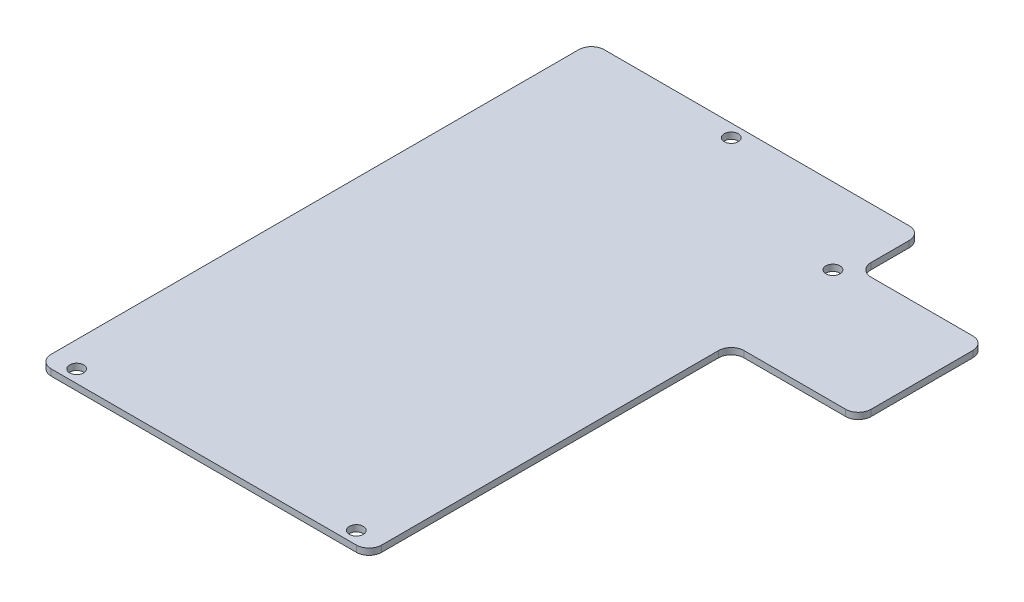
ISO-10303-21;
HEADER;
FILE_DESCRIPTION(('STEP AP214'),'2;1');
FILE_NAME('part.step','',(''),(''),'','','');
FILE_SCHEMA(('AUTOMOTIVE_DESIGN { 1 0 10303 214 1 1 1 1 }'));
ENDSEC;
DATA;
#1=APPLICATION_CONTEXT('core data for automotive mechanical design processes');
#2=APPLICATION_PROTOCOL_DEFINITION('international standard','automotive_design',2000,#1);
#3=PRODUCT_CONTEXT('',#1,'mechanical');
#4=PRODUCT('Part','Part','',(#3));
#5=PRODUCT_RELATED_PRODUCT_CATEGORY('part','',(#4));
#6=PRODUCT_DEFINITION_FORMATION('','',#4);
#7=PRODUCT_DEFINITION_CONTEXT('part definition',#1,'design');
#8=PRODUCT_DEFINITION('design','',#6,#7);
#9=PRODUCT_DEFINITION_SHAPE('','',#8);
#10=(LENGTH_UNIT() NAMED_UNIT(*) SI_UNIT(.MILLI.,.METRE.));
#11=(NAMED_UNIT(*) PLANE_ANGLE_UNIT() SI_UNIT($,.RADIAN.));
#12=(NAMED_UNIT(*) SI_UNIT($,.STERADIAN.) SOLID_ANGLE_UNIT());
#13=UNCERTAINTY_MEASURE_WITH_UNIT(LENGTH_MEASURE(1.E-05),#10,'distance_accuracy_value','');
#14=(GEOMETRIC_REPRESENTATION_CONTEXT(3) GLOBAL_UNCERTAINTY_ASSIGNED_CONTEXT((#13)) GLOBAL_UNIT_ASSIGNED_CONTEXT((#10,
#11,#12)) REPRESENTATION_CONTEXT('',''));
#15=CARTESIAN_POINT('',(0.,0.,0.));
#16=DIRECTION('',(0.,0.,1.));
#17=DIRECTION('',(1.,0.,0.));
#18=AXIS2_PLACEMENT_3D('',#15,#16,#17);
#19=CARTESIAN_POINT('',(0.,1.,0.));
#20=DIRECTION('',(1.,0.,0.));
#21=DIRECTION('',(0.,0.,-1.));
#22=AXIS2_PLACEMENT_3D('',#19,#20,#21);
#23=PLANE('',#22);
#24=DIRECTION('',(0.,0.,1.));
#25=VECTOR('',#24,1.);
#26=CARTESIAN_POINT('',(0.,1.,0.));
#27=LINE('',#26,#25);
#28=CARTESIAN_POINT('',(0.,1.,-85.));
#29=VERTEX_POINT('',#28);
#30=CARTESIAN_POINT('',(0.,1.,-2.));
#31=VERTEX_POINT('',#30);
#32=EDGE_CURVE('E174',#29,#31,#27,.T.);
#33=ORIENTED_EDGE('',*,*,#32,.F.);
#34=DIRECTION('',(0.,-1.,0.));
#35=VECTOR('',#34,1.);
#36=CARTESIAN_POINT('',(0.,1.,-85.));
#37=LINE('',#36,#35);
#38=CARTESIAN_POINT('',(0.,0.,-85.));
#39=VERTEX_POINT('',#38);
#40=EDGE_CURVE('E158',#29,#39,#37,.T.);
#41=ORIENTED_EDGE('',*,*,#40,.T.);
#42=DIRECTION('',(0.,0.,1.));
#43=VECTOR('',#42,1.);
#44=CARTESIAN_POINT('',(0.,0.,0.));
#45=LINE('',#44,#43);
#46=CARTESIAN_POINT('',(0.,0.,-2.));
#47=VERTEX_POINT('',#46);
#48=EDGE_CURVE('E171',#39,#47,#45,.T.);
#49=ORIENTED_EDGE('',*,*,#48,.T.);
#50=DIRECTION('',(0.,-1.,0.));
#51=VECTOR('',#50,1.);
#52=CARTESIAN_POINT('',(0.,1.,-2.));
#53=LINE('',#52,#51);
#54=EDGE_CURVE('E177',#47,#31,#53,.F.);
#55=ORIENTED_EDGE('',*,*,#54,.T.);
#56=EDGE_LOOP('',(#33,#41,#49,#55));
#57=FACE_BOUND('',#56,.T.);
#58=ADVANCED_FACE('F39',(#57),#23,.F.);
#59=CARTESIAN_POINT('',(0.,1.,0.));
#60=DIRECTION('',(0.,0.,-1.));
#61=DIRECTION('',(-1.,0.,0.));
#62=AXIS2_PLACEMENT_3D('',#59,#60,#61);
#63=PLANE('',#62);
#64=DIRECTION('',(1.,0.,0.));
#65=VECTOR('',#64,1.);
#66=CARTESIAN_POINT('',(0.,0.,0.));
#67=LINE('',#66,#65);
#68=CARTESIAN_POINT('',(2.,0.,0.));
#69=VERTEX_POINT('',#68);
#70=CARTESIAN_POINT('',(50.,0.,0.));
#71=VERTEX_POINT('',#70);
#72=EDGE_CURVE('E182',#69,#71,#67,.T.);
#73=ORIENTED_EDGE('',*,*,#72,.T.);
#74=DIRECTION('',(0.,-1.,0.));
#75=VECTOR('',#74,1.);
#76=CARTESIAN_POINT('',(50.,1.,0.));
#77=LINE('',#76,#75);
#78=CARTESIAN_POINT('',(50.,1.,0.));
#79=VERTEX_POINT('',#78);
#80=EDGE_CURVE('E306',#71,#79,#77,.F.);
#81=ORIENTED_EDGE('',*,*,#80,.T.);
#82=DIRECTION('',(1.,0.,0.));
#83=VECTOR('',#82,1.);
#84=CARTESIAN_POINT('',(0.,1.,0.));
#85=LINE('',#84,#83);
#86=CARTESIAN_POINT('',(2.,1.,0.));
#87=VERTEX_POINT('',#86);
#88=EDGE_CURVE('E344',#87,#79,#85,.T.);
#89=ORIENTED_EDGE('',*,*,#88,.F.);
#90=DIRECTION('',(0.,-1.,0.));
#91=VECTOR('',#90,1.);
#92=CARTESIAN_POINT('',(2.,1.,0.));
#93=LINE('',#92,#91);
#94=EDGE_CURVE('E302',#87,#69,#93,.T.);
#95=ORIENTED_EDGE('',*,*,#94,.T.);
#96=EDGE_LOOP('',(#73,#81,#89,#95));
#97=FACE_BOUND('',#96,.T.);
#98=ADVANCED_FACE('F391',(#97),#63,.F.);
#99=CARTESIAN_POINT('',(52.,1.,0.));
#100=DIRECTION('',(-1.,0.,0.));
#101=DIRECTION('',(0.,0.,1.));
#102=AXIS2_PLACEMENT_3D('',#99,#100,#101);
#103=PLANE('',#102);
#104=DIRECTION('',(0.,0.,-1.));
#105=VECTOR('',#104,1.);
#106=CARTESIAN_POINT('',(52.,0.,0.));
#107=LINE('',#106,#105);
#108=CARTESIAN_POINT('',(52.,0.,-2.));
#109=VERTEX_POINT('',#108);
#110=CARTESIAN_POINT('',(52.,0.,-55.));
#111=VERTEX_POINT('',#110);
#112=EDGE_CURVE('E188',#109,#111,#107,.T.);
#113=ORIENTED_EDGE('',*,*,#112,.T.);
#114=DIRECTION('',(0.,-1.,0.));
#115=VECTOR('',#114,1.);
#116=CARTESIAN_POINT('',(52.,1.,-55.));
#117=LINE('',#116,#115);
#118=CARTESIAN_POINT('',(52.,1.,-55.));
#119=VERTEX_POINT('',#118);
#120=EDGE_CURVE('E299',#111,#119,#117,.F.);
#121=ORIENTED_EDGE('',*,*,#120,.T.);
#122=DIRECTION('',(0.,0.,-1.));
#123=VECTOR('',#122,1.);
#124=CARTESIAN_POINT('',(52.,1.,0.));
#125=LINE('',#124,#123);
#126=CARTESIAN_POINT('',(52.,1.,-2.));
#127=VERTEX_POINT('',#126);
#128=EDGE_CURVE('E332',#127,#119,#125,.T.);
#129=ORIENTED_EDGE('',*,*,#128,.F.);
#130=DIRECTION('',(0.,-1.,0.));
#131=VECTOR('',#130,1.);
#132=CARTESIAN_POINT('',(52.,1.,-2.));
#133=LINE('',#132,#131);
#134=EDGE_CURVE('E295',#127,#109,#133,.T.);
#135=ORIENTED_EDGE('',*,*,#134,.T.);
#136=EDGE_LOOP('',(#113,#121,#129,#135));
#137=FACE_BOUND('',#136,.T.);
#138=ADVANCED_FACE('F320',(#137),#103,.F.);
#139=CARTESIAN_POINT('',(52.,1.,-57.));
#140=DIRECTION('',(0.,0.,-1.));
#141=DIRECTION('',(-1.,0.,0.));
#142=AXIS2_PLACEMENT_3D('',#139,#140,#141);
#143=PLANE('',#142);
#144=DIRECTION('',(1.,0.,0.));
#145=VECTOR('',#144,1.);
#146=CARTESIAN_POINT('',(52.,0.,-57.));
#147=LINE('',#146,#145);
#148=CARTESIAN_POINT('',(54.,0.,-57.));
#149=VERTEX_POINT('',#148);
#150=CARTESIAN_POINT('',(70.,0.,-57.));
#151=VERTEX_POINT('',#150);
#152=EDGE_CURVE('E200',#149,#151,#147,.T.);
#153=ORIENTED_EDGE('',*,*,#152,.T.);
#154=DIRECTION('',(0.,-1.,0.));
#155=VECTOR('',#154,1.);
#156=CARTESIAN_POINT('',(70.,1.,-57.));
#157=LINE('',#156,#155);
#158=CARTESIAN_POINT('',(70.,1.,-57.));
#159=VERTEX_POINT('',#158);
#160=EDGE_CURVE('E292',#151,#159,#157,.F.);
#161=ORIENTED_EDGE('',*,*,#160,.T.);
#162=DIRECTION('',(1.,0.,0.));
#163=VECTOR('',#162,1.);
#164=CARTESIAN_POINT('',(52.,1.,-57.));
#165=LINE('',#164,#163);
#166=CARTESIAN_POINT('',(54.,1.,-57.));
#167=VERTEX_POINT('',#166);
#168=EDGE_CURVE('E330',#167,#159,#165,.T.);
#169=ORIENTED_EDGE('',*,*,#168,.F.);
#170=DIRECTION('',(0.,-1.,0.));
#171=VECTOR('',#170,1.);
#172=CARTESIAN_POINT('',(54.,0.,-57.));
#173=LINE('',#172,#171);
#174=EDGE_CURVE('E288',#167,#149,#173,.T.);
#175=ORIENTED_EDGE('',*,*,#174,.T.);
#176=EDGE_LOOP('',(#153,#161,#169,#175));
#177=FACE_BOUND('',#176,.T.);
#178=ADVANCED_FACE('F334',(#177),#143,.F.);
#179=CARTESIAN_POINT('',(72.,1.,-77.));
#180=DIRECTION('',(-1.,0.,0.));
#181=DIRECTION('',(0.,0.,1.));
#182=AXIS2_PLACEMENT_3D('',#179,#180,#181);
#183=PLANE('',#182);
#184=DIRECTION('',(0.,0.,-1.));
#185=VECTOR('',#184,1.);
#186=CARTESIAN_POINT('',(72.,0.,-77.));
#187=LINE('',#186,#185);
#188=CARTESIAN_POINT('',(72.,0.,-59.));
#189=VERTEX_POINT('',#188);
#190=CARTESIAN_POINT('',(72.,0.,-75.));
#191=VERTEX_POINT('',#190);
#192=EDGE_CURVE('E204',#189,#191,#187,.T.);
#193=ORIENTED_EDGE('',*,*,#192,.T.);
#194=DIRECTION('',(0.,-1.,0.));
#195=VECTOR('',#194,1.);
#196=CARTESIAN_POINT('',(72.,1.,-75.));
#197=LINE('',#196,#195);
#198=CARTESIAN_POINT('',(72.,1.,-75.));
#199=VERTEX_POINT('',#198);
#200=EDGE_CURVE('E285',#191,#199,#197,.F.);
#201=ORIENTED_EDGE('',*,*,#200,.T.);
#202=DIRECTION('',(0.,0.,-1.));
#203=VECTOR('',#202,1.);
#204=CARTESIAN_POINT('',(72.,1.,-77.));
#205=LINE('',#204,#203);
#206=CARTESIAN_POINT('',(72.,1.,-59.));
#207=VERTEX_POINT('',#206);
#208=EDGE_CURVE('E337',#207,#199,#205,.T.);
#209=ORIENTED_EDGE('',*,*,#208,.F.);
#210=DIRECTION('',(0.,-1.,0.));
#211=VECTOR('',#210,1.);
#212=CARTESIAN_POINT('',(72.,1.,-59.));
#213=LINE('',#212,#211);
#214=EDGE_CURVE('E281',#207,#189,#213,.T.);
#215=ORIENTED_EDGE('',*,*,#214,.T.);
#216=EDGE_LOOP('',(#193,#201,#209,#215));
#217=FACE_BOUND('',#216,.T.);
#218=ADVANCED_FACE('F376',(#217),#183,.F.);
#219=CARTESIAN_POINT('',(52.,1.,-77.));
#220=DIRECTION('',(0.,0.,1.));
#221=DIRECTION('',(1.,0.,0.));
#222=AXIS2_PLACEMENT_3D('',#219,#220,#221);
#223=PLANE('',#222);
#224=DIRECTION('',(-1.,0.,0.));
#225=VECTOR('',#224,1.);
#226=CARTESIAN_POINT('',(52.,0.,-77.));
#227=LINE('',#226,#225);
#228=CARTESIAN_POINT('',(70.,0.,-77.));
#229=VERTEX_POINT('',#228);
#230=CARTESIAN_POINT('',(54.,0.,-77.));
#231=VERTEX_POINT('',#230);
#232=EDGE_CURVE('E208',#229,#231,#227,.T.);
#233=ORIENTED_EDGE('',*,*,#232,.T.);
#234=DIRECTION('',(0.,-1.,0.));
#235=VECTOR('',#234,1.);
#236=CARTESIAN_POINT('',(54.,1.,-77.));
#237=LINE('',#236,#235);
#238=CARTESIAN_POINT('',(54.,1.,-77.));
#239=VERTEX_POINT('',#238);
#240=EDGE_CURVE('E278',#231,#239,#237,.F.);
#241=ORIENTED_EDGE('',*,*,#240,.T.);
#242=DIRECTION('',(-1.,0.,0.));
#243=VECTOR('',#242,1.);
#244=CARTESIAN_POINT('',(52.,1.,-77.));
#245=LINE('',#244,#243);
#246=CARTESIAN_POINT('',(70.,1.,-77.));
#247=VERTEX_POINT('',#246);
#248=EDGE_CURVE('E342',#247,#239,#245,.T.);
#249=ORIENTED_EDGE('',*,*,#248,.F.);
#250=DIRECTION('',(0.,-1.,0.));
#251=VECTOR('',#250,1.);
#252=CARTESIAN_POINT('',(70.,1.,-77.));
#253=LINE('',#252,#251);
#254=EDGE_CURVE('E274',#247,#229,#253,.T.);
#255=ORIENTED_EDGE('',*,*,#254,.T.);
#256=EDGE_LOOP('',(#233,#241,#249,#255));
#257=FACE_BOUND('',#256,.T.);
#258=ADVANCED_FACE('F367',(#257),#223,.F.);
#259=CARTESIAN_POINT('',(52.,1.,-77.));
#260=DIRECTION('',(-1.,0.,0.));
#261=DIRECTION('',(0.,0.,1.));
#262=AXIS2_PLACEMENT_3D('',#259,#260,#261);
#263=PLANE('',#262);
#264=DIRECTION('',(0.,0.,-1.));
#265=VECTOR('',#264,1.);
#266=CARTESIAN_POINT('',(52.,0.,-77.));
#267=LINE('',#266,#265);
#268=CARTESIAN_POINT('',(52.,0.,-79.));
#269=VERTEX_POINT('',#268);
#270=CARTESIAN_POINT('',(52.,0.,-85.));
#271=VERTEX_POINT('',#270);
#272=EDGE_CURVE('E212',#269,#271,#267,.T.);
#273=ORIENTED_EDGE('',*,*,#272,.T.);
#274=DIRECTION('',(0.,-1.,0.));
#275=VECTOR('',#274,1.);
#276=CARTESIAN_POINT('',(52.,1.,-85.));
#277=LINE('',#276,#275);
#278=CARTESIAN_POINT('',(52.,1.,-85.));
#279=VERTEX_POINT('',#278);
#280=EDGE_CURVE('E55',#271,#279,#277,.F.);
#281=ORIENTED_EDGE('',*,*,#280,.T.);
#282=DIRECTION('',(0.,0.,-1.));
#283=VECTOR('',#282,1.);
#284=CARTESIAN_POINT('',(52.,1.,-77.));
#285=LINE('',#284,#283);
#286=CARTESIAN_POINT('',(52.,1.,-79.));
#287=VERTEX_POINT('',#286);
#288=EDGE_CURVE('E349',#287,#279,#285,.T.);
#289=ORIENTED_EDGE('',*,*,#288,.F.);
#290=DIRECTION('',(0.,-1.,0.));
#291=VECTOR('',#290,1.);
#292=CARTESIAN_POINT('',(52.,0.,-79.));
#293=LINE('',#292,#291);
#294=EDGE_CURVE('E268',#287,#269,#293,.T.);
#295=ORIENTED_EDGE('',*,*,#294,.T.);
#296=EDGE_LOOP('',(#273,#281,#289,#295));
#297=FACE_BOUND('',#296,.T.);
#298=ADVANCED_FACE('F360',(#297),#263,.F.);
#299=CARTESIAN_POINT('',(0.,1.,-87.));
#300=DIRECTION('',(0.,0.,1.));
#301=DIRECTION('',(1.,0.,0.));
#302=AXIS2_PLACEMENT_3D('',#299,#300,#301);
#303=PLANE('',#302);
#304=DIRECTION('',(-1.,0.,0.));
#305=VECTOR('',#304,1.);
#306=CARTESIAN_POINT('',(0.,0.,-87.));
#307=LINE('',#306,#305);
#308=CARTESIAN_POINT('',(50.,0.,-87.));
#309=VERTEX_POINT('',#308);
#310=CARTESIAN_POINT('',(2.,0.,-87.));
#311=VERTEX_POINT('',#310);
#312=EDGE_CURVE('E215',#309,#311,#307,.T.);
#313=ORIENTED_EDGE('',*,*,#312,.T.);
#314=DIRECTION('',(0.,-1.,0.));
#315=VECTOR('',#314,1.);
#316=CARTESIAN_POINT('',(2.,1.,-87.));
#317=LINE('',#316,#315);
#318=CARTESIAN_POINT('',(2.,1.,-87.));
#319=VERTEX_POINT('',#318);
#320=EDGE_CURVE('E159',#311,#319,#317,.F.);
#321=ORIENTED_EDGE('',*,*,#320,.T.);
#322=DIRECTION('',(-1.,0.,0.));
#323=VECTOR('',#322,1.);
#324=CARTESIAN_POINT('',(0.,1.,-87.));
#325=LINE('',#324,#323);
#326=CARTESIAN_POINT('',(50.,1.,-87.));
#327=VERTEX_POINT('',#326);
#328=EDGE_CURVE('E194',#327,#319,#325,.T.);
#329=ORIENTED_EDGE('',*,*,#328,.F.);
#330=DIRECTION('',(0.,-1.,0.));
#331=VECTOR('',#330,1.);
#332=CARTESIAN_POINT('',(50.,1.,-87.));
#333=LINE('',#332,#331);
#334=EDGE_CURVE('E165',#327,#309,#333,.T.);
#335=ORIENTED_EDGE('',*,*,#334,.T.);
#336=EDGE_LOOP('',(#313,#321,#329,#335));
#337=FACE_BOUND('',#336,.T.);
#338=ADVANCED_FACE('F356',(#337),#303,.F.);
#339=CARTESIAN_POINT('',(0.,1.,0.));
#340=DIRECTION('',(0.,-1.,0.));
#341=DIRECTION('',(0.,0.,-1.));
#342=AXIS2_PLACEMENT_3D('',#339,#340,#341);
#343=PLANE('',#342);
#344=CARTESIAN_POINT('',(4.,1.,-2.));
#345=DIRECTION('',(0.,1.,0.));
#346=DIRECTION('',(0.,0.,1.));
#347=AXIS2_PLACEMENT_3D('',#344,#345,#346);
#348=CIRCLE('',#347,1.1);
#349=CARTESIAN_POINT('',(4.,1.,-0.900000000000003));
#350=VERTEX_POINT('',#349);
#351=EDGE_CURVE('E223',#350,#350,#348,.T.);
#352=ORIENTED_EDGE('',*,*,#351,.F.);
#353=EDGE_LOOP('',(#352));
#354=FACE_BOUND('',#353,.T.);
#355=CARTESIAN_POINT('',(50.,1.,-75.));
#356=DIRECTION('',(0.,1.,0.));
#357=DIRECTION('',(0.,0.,1.));
#358=AXIS2_PLACEMENT_3D('',#355,#356,#357);
#359=CIRCLE('',#358,1.10000000000001);
#360=CARTESIAN_POINT('',(50.,1.,-73.9));
#361=VERTEX_POINT('',#360);
#362=EDGE_CURVE('E459',#361,#361,#359,.T.);
#363=ORIENTED_EDGE('',*,*,#362,.F.);
#364=EDGE_LOOP('',(#363));
#365=FACE_BOUND('',#364,.T.);
#366=CARTESIAN_POINT('',(24.,1.,-85.));
#367=DIRECTION('',(0.,1.,0.));
#368=DIRECTION('',(0.,0.,1.));
#369=AXIS2_PLACEMENT_3D('',#366,#367,#368);
#370=CIRCLE('',#369,1.1);
#371=CARTESIAN_POINT('',(24.,1.,-83.9));
#372=VERTEX_POINT('',#371);
#373=EDGE_CURVE('E454',#372,#372,#370,.T.);
#374=ORIENTED_EDGE('',*,*,#373,.F.);
#375=EDGE_LOOP('',(#374));
#376=FACE_BOUND('',#375,.T.);
#377=CARTESIAN_POINT('',(48.,1.,-2.));
#378=DIRECTION('',(0.,1.,0.));
#379=DIRECTION('',(0.,0.,1.));
#380=AXIS2_PLACEMENT_3D('',#377,#378,#379);
#381=CIRCLE('',#380,1.1);
#382=CARTESIAN_POINT('',(48.,1.,-0.900000000000001));
#383=VERTEX_POINT('',#382);
#384=EDGE_CURVE('E458',#383,#383,#381,.T.);
#385=ORIENTED_EDGE('',*,*,#384,.F.);
#386=EDGE_LOOP('',(#385));
#387=FACE_BOUND('',#386,.T.);
#388=ORIENTED_EDGE('',*,*,#328,.T.);
#389=CARTESIAN_POINT('',(2.,1.,-85.));
#390=DIRECTION('',(0.,-1.,0.));
#391=DIRECTION('',(0.,0.,-1.));
#392=AXIS2_PLACEMENT_3D('',#389,#390,#391);
#393=CIRCLE('',#392,2.);
#394=EDGE_CURVE('E265',#319,#29,#393,.F.);
#395=ORIENTED_EDGE('',*,*,#394,.T.);
#396=ORIENTED_EDGE('',*,*,#32,.T.);
#397=CARTESIAN_POINT('',(2.,1.,-2.));
#398=DIRECTION('',(0.,-1.,0.));
#399=DIRECTION('',(0.,0.,-1.));
#400=AXIS2_PLACEMENT_3D('',#397,#398,#399);
#401=CIRCLE('',#400,2.);
#402=EDGE_CURVE('E250',#31,#87,#401,.F.);
#403=ORIENTED_EDGE('',*,*,#402,.T.);
#404=ORIENTED_EDGE('',*,*,#88,.T.);
#405=CARTESIAN_POINT('',(50.,1.,-2.));
#406=DIRECTION('',(0.,-1.,0.));
#407=DIRECTION('',(0.,0.,-1.));
#408=AXIS2_PLACEMENT_3D('',#405,#406,#407);
#409=CIRCLE('',#408,2.);
#410=EDGE_CURVE('E253',#79,#127,#409,.F.);
#411=ORIENTED_EDGE('',*,*,#410,.T.);
#412=ORIENTED_EDGE('',*,*,#128,.T.);
#413=CARTESIAN_POINT('',(54.,1.,-55.));
#414=DIRECTION('',(0.,-1.,0.));
#415=DIRECTION('',(0.,0.,-1.));
#416=AXIS2_PLACEMENT_3D('',#413,#414,#415);
#417=CIRCLE('',#416,2.);
#418=EDGE_CURVE('E11',#119,#167,#417,.T.);
#419=ORIENTED_EDGE('',*,*,#418,.T.);
#420=ORIENTED_EDGE('',*,*,#168,.T.);
#421=CARTESIAN_POINT('',(70.,1.,-59.));
#422=DIRECTION('',(0.,-1.,0.));
#423=DIRECTION('',(0.,0.,-1.));
#424=AXIS2_PLACEMENT_3D('',#421,#422,#423);
#425=CIRCLE('',#424,2.);
#426=EDGE_CURVE('E256',#159,#207,#425,.F.);
#427=ORIENTED_EDGE('',*,*,#426,.T.);
#428=ORIENTED_EDGE('',*,*,#208,.T.);
#429=CARTESIAN_POINT('',(70.,1.,-75.));
#430=DIRECTION('',(0.,-1.,0.));
#431=DIRECTION('',(0.,0.,-1.));
#432=AXIS2_PLACEMENT_3D('',#429,#430,#431);
#433=CIRCLE('',#432,2.);
#434=EDGE_CURVE('E259',#199,#247,#433,.F.);
#435=ORIENTED_EDGE('',*,*,#434,.T.);
#436=ORIENTED_EDGE('',*,*,#248,.T.);
#437=CARTESIAN_POINT('',(54.,1.,-79.));
#438=DIRECTION('',(0.,-1.,0.));
#439=DIRECTION('',(0.,0.,-1.));
#440=AXIS2_PLACEMENT_3D('',#437,#438,#439);
#441=CIRCLE('',#440,2.);
#442=EDGE_CURVE('E62',#239,#287,#441,.T.);
#443=ORIENTED_EDGE('',*,*,#442,.T.);
#444=ORIENTED_EDGE('',*,*,#288,.T.);
#445=CARTESIAN_POINT('',(50.,1.,-85.));
#446=DIRECTION('',(0.,-1.,0.));
#447=DIRECTION('',(0.,0.,-1.));
#448=AXIS2_PLACEMENT_3D('',#445,#446,#447);
#449=CIRCLE('',#448,2.);
#450=EDGE_CURVE('E262',#279,#327,#449,.F.);
#451=ORIENTED_EDGE('',*,*,#450,.T.);
#452=EDGE_LOOP('',(#388,#395,#396,#403,#404,#411,#412,#419,#420,#427,#428,#435,#436,#443,#444,#451));
#453=FACE_BOUND('',#452,.T.);
#454=ADVANCED_FACE('F329',(#354,#365,#376,#387,#453),#343,.F.);
#455=CARTESIAN_POINT('',(0.,0.,0.));
#456=DIRECTION('',(0.,-1.,0.));
#457=DIRECTION('',(0.,0.,-1.));
#458=AXIS2_PLACEMENT_3D('',#455,#456,#457);
#459=PLANE('',#458);
#460=CARTESIAN_POINT('',(4.,0.,-2.));
#461=DIRECTION('',(0.,-1.,0.));
#462=DIRECTION('',(0.,0.,-1.));
#463=AXIS2_PLACEMENT_3D('',#460,#461,#462);
#464=CIRCLE('',#463,1.1);
#465=CARTESIAN_POINT('',(4.,0.,-3.1));
#466=VERTEX_POINT('',#465);
#467=EDGE_CURVE('E183',#466,#466,#464,.T.);
#468=ORIENTED_EDGE('',*,*,#467,.F.);
#469=EDGE_LOOP('',(#468));
#470=FACE_BOUND('',#469,.T.);
#471=CARTESIAN_POINT('',(50.,0.,-75.));
#472=DIRECTION('',(0.,-1.,0.));
#473=DIRECTION('',(0.,0.,-1.));
#474=AXIS2_PLACEMENT_3D('',#471,#472,#473);
#475=CIRCLE('',#474,1.10000000000001);
#476=CARTESIAN_POINT('',(50.,0.,-76.1));
#477=VERTEX_POINT('',#476);
#478=EDGE_CURVE('E191',#477,#477,#475,.T.);
#479=ORIENTED_EDGE('',*,*,#478,.F.);
#480=EDGE_LOOP('',(#479));
#481=FACE_BOUND('',#480,.T.);
#482=CARTESIAN_POINT('',(24.,0.,-85.));
#483=DIRECTION('',(0.,-1.,0.));
#484=DIRECTION('',(0.,0.,-1.));
#485=AXIS2_PLACEMENT_3D('',#482,#483,#484);
#486=CIRCLE('',#485,1.1);
#487=CARTESIAN_POINT('',(24.,0.,-86.1));
#488=VERTEX_POINT('',#487);
#489=EDGE_CURVE('E222',#488,#488,#486,.T.);
#490=ORIENTED_EDGE('',*,*,#489,.F.);
#491=EDGE_LOOP('',(#490));
#492=FACE_BOUND('',#491,.T.);
#493=CARTESIAN_POINT('',(48.,0.,-2.));
#494=DIRECTION('',(0.,-1.,0.));
#495=DIRECTION('',(0.,0.,-1.));
#496=AXIS2_PLACEMENT_3D('',#493,#494,#495);
#497=CIRCLE('',#496,1.1);
#498=CARTESIAN_POINT('',(48.,0.,-3.1));
#499=VERTEX_POINT('',#498);
#500=EDGE_CURVE('E218',#499,#499,#497,.T.);
#501=ORIENTED_EDGE('',*,*,#500,.F.);
#502=EDGE_LOOP('',(#501));
#503=FACE_BOUND('',#502,.T.);
#504=ORIENTED_EDGE('',*,*,#48,.F.);
#505=CARTESIAN_POINT('',(2.,0.,-85.));
#506=DIRECTION('',(0.,-1.,0.));
#507=DIRECTION('',(0.,0.,-1.));
#508=AXIS2_PLACEMENT_3D('',#505,#506,#507);
#509=CIRCLE('',#508,2.);
#510=EDGE_CURVE('E154',#39,#311,#509,.T.);
#511=ORIENTED_EDGE('',*,*,#510,.T.);
#512=ORIENTED_EDGE('',*,*,#312,.F.);
#513=CARTESIAN_POINT('',(50.,0.,-85.));
#514=DIRECTION('',(0.,-1.,0.));
#515=DIRECTION('',(0.,0.,-1.));
#516=AXIS2_PLACEMENT_3D('',#513,#514,#515);
#517=CIRCLE('',#516,2.);
#518=EDGE_CURVE('E166',#309,#271,#517,.T.);
#519=ORIENTED_EDGE('',*,*,#518,.T.);
#520=ORIENTED_EDGE('',*,*,#272,.F.);
#521=CARTESIAN_POINT('',(54.,0.,-79.));
#522=DIRECTION('',(0.,-1.,0.));
#523=DIRECTION('',(0.,0.,-1.));
#524=AXIS2_PLACEMENT_3D('',#521,#522,#523);
#525=CIRCLE('',#524,2.);
#526=EDGE_CURVE('E309',#269,#231,#525,.F.);
#527=ORIENTED_EDGE('',*,*,#526,.T.);
#528=ORIENTED_EDGE('',*,*,#232,.F.);
#529=CARTESIAN_POINT('',(70.,0.,-75.));
#530=DIRECTION('',(0.,-1.,0.));
#531=DIRECTION('',(0.,0.,-1.));
#532=AXIS2_PLACEMENT_3D('',#529,#530,#531);
#533=CIRCLE('',#532,2.);
#534=EDGE_CURVE('E240',#229,#191,#533,.T.);
#535=ORIENTED_EDGE('',*,*,#534,.T.);
#536=ORIENTED_EDGE('',*,*,#192,.F.);
#537=CARTESIAN_POINT('',(70.,0.,-59.));
#538=DIRECTION('',(0.,-1.,0.));
#539=DIRECTION('',(0.,0.,-1.));
#540=AXIS2_PLACEMENT_3D('',#537,#538,#539);
#541=CIRCLE('',#540,2.);
#542=EDGE_CURVE('E237',#189,#151,#541,.T.);
#543=ORIENTED_EDGE('',*,*,#542,.T.);
#544=ORIENTED_EDGE('',*,*,#152,.F.);
#545=CARTESIAN_POINT('',(54.,0.,-55.));
#546=DIRECTION('',(0.,-1.,0.));
#547=DIRECTION('',(0.,0.,-1.));
#548=AXIS2_PLACEMENT_3D('',#545,#546,#547);
#549=CIRCLE('',#548,2.);
#550=EDGE_CURVE('E48',#149,#111,#549,.F.);
#551=ORIENTED_EDGE('',*,*,#550,.T.);
#552=ORIENTED_EDGE('',*,*,#112,.F.);
#553=CARTESIAN_POINT('',(50.,0.,-2.));
#554=DIRECTION('',(0.,-1.,0.));
#555=DIRECTION('',(0.,0.,-1.));
#556=AXIS2_PLACEMENT_3D('',#553,#554,#555);
#557=CIRCLE('',#556,2.);
#558=EDGE_CURVE('E234',#109,#71,#557,.T.);
#559=ORIENTED_EDGE('',*,*,#558,.T.);
#560=ORIENTED_EDGE('',*,*,#72,.F.);
#561=CARTESIAN_POINT('',(2.,0.,-2.));
#562=DIRECTION('',(0.,-1.,0.));
#563=DIRECTION('',(0.,0.,-1.));
#564=AXIS2_PLACEMENT_3D('',#561,#562,#563);
#565=CIRCLE('',#564,2.);
#566=EDGE_CURVE('E176',#69,#47,#565,.T.);
#567=ORIENTED_EDGE('',*,*,#566,.T.);
#568=EDGE_LOOP('',(#504,#511,#512,#519,#520,#527,#528,#535,#536,#543,#544,#551,#552,#559,#560,#567));
#569=FACE_BOUND('',#568,.T.);
#570=ADVANCED_FACE('F179',(#470,#481,#492,#503,#569),#459,.T.);
#571=CARTESIAN_POINT('',(48.,-3.,-2.));
#572=DIRECTION('',(0.,1.,0.));
#573=DIRECTION('',(0.,0.,1.));
#574=AXIS2_PLACEMENT_3D('',#571,#572,#573);
#575=CYLINDRICAL_SURFACE('',#574,1.1);
#576=ORIENTED_EDGE('',*,*,#500,.T.);
#577=EDGE_LOOP('',(#576));
#578=FACE_BOUND('',#577,.T.);
#579=ORIENTED_EDGE('',*,*,#384,.T.);
#580=EDGE_LOOP('',(#579));
#581=FACE_BOUND('',#580,.T.);
#582=ADVANCED_FACE('F480',(#578,#581),#575,.F.);
#583=CARTESIAN_POINT('',(24.,-3.,-85.));
#584=DIRECTION('',(0.,1.,0.));
#585=DIRECTION('',(0.,0.,1.));
#586=AXIS2_PLACEMENT_3D('',#583,#584,#585);
#587=CYLINDRICAL_SURFACE('',#586,1.1);
#588=ORIENTED_EDGE('',*,*,#489,.T.);
#589=EDGE_LOOP('',(#588));
#590=FACE_BOUND('',#589,.T.);
#591=ORIENTED_EDGE('',*,*,#373,.T.);
#592=EDGE_LOOP('',(#591));
#593=FACE_BOUND('',#592,.T.);
#594=ADVANCED_FACE('F482',(#590,#593),#587,.F.);
#595=CARTESIAN_POINT('',(50.,-3.,-75.));
#596=DIRECTION('',(0.,1.,0.));
#597=DIRECTION('',(0.,0.,1.));
#598=AXIS2_PLACEMENT_3D('',#595,#596,#597);
#599=CYLINDRICAL_SURFACE('',#598,1.10000000000001);
#600=ORIENTED_EDGE('',*,*,#478,.T.);
#601=EDGE_LOOP('',(#600));
#602=FACE_BOUND('',#601,.T.);
#603=ORIENTED_EDGE('',*,*,#362,.T.);
#604=EDGE_LOOP('',(#603));
#605=FACE_BOUND('',#604,.T.);
#606=ADVANCED_FACE('F489',(#602,#605),#599,.F.);
#607=CARTESIAN_POINT('',(4.,-3.,-2.));
#608=DIRECTION('',(0.,1.,0.));
#609=DIRECTION('',(0.,0.,1.));
#610=AXIS2_PLACEMENT_3D('',#607,#608,#609);
#611=CYLINDRICAL_SURFACE('',#610,1.1);
#612=ORIENTED_EDGE('',*,*,#467,.T.);
#613=EDGE_LOOP('',(#612));
#614=FACE_BOUND('',#613,.T.);
#615=ORIENTED_EDGE('',*,*,#351,.T.);
#616=EDGE_LOOP('',(#615));
#617=FACE_BOUND('',#616,.T.);
#618=ADVANCED_FACE('F402',(#614,#617),#611,.F.);
#619=CARTESIAN_POINT('',(2.,1.,-85.));
#620=DIRECTION('',(0.,-1.,0.));
#621=DIRECTION('',(0.,0.,-1.));
#622=AXIS2_PLACEMENT_3D('',#619,#620,#621);
#623=CYLINDRICAL_SURFACE('',#622,2.);
#624=ORIENTED_EDGE('',*,*,#394,.F.);
#625=ORIENTED_EDGE('',*,*,#320,.F.);
#626=ORIENTED_EDGE('',*,*,#510,.F.);
#627=ORIENTED_EDGE('',*,*,#40,.F.);
#628=EDGE_LOOP('',(#624,#625,#626,#627));
#629=FACE_BOUND('',#628,.T.);
#630=ADVANCED_FACE('F157',(#629),#623,.T.);
#631=CARTESIAN_POINT('',(50.,1.,-85.));
#632=DIRECTION('',(0.,-1.,0.));
#633=DIRECTION('',(0.,0.,-1.));
#634=AXIS2_PLACEMENT_3D('',#631,#632,#633);
#635=CYLINDRICAL_SURFACE('',#634,2.);
#636=ORIENTED_EDGE('',*,*,#450,.F.);
#637=ORIENTED_EDGE('',*,*,#280,.F.);
#638=ORIENTED_EDGE('',*,*,#518,.F.);
#639=ORIENTED_EDGE('',*,*,#334,.F.);
#640=EDGE_LOOP('',(#636,#637,#638,#639));
#641=FACE_BOUND('',#640,.T.);
#642=ADVANCED_FACE('F358',(#641),#635,.T.);
#643=CARTESIAN_POINT('',(54.,1.,-79.));
#644=DIRECTION('',(0.,1.,0.));
#645=DIRECTION('',(0.,0.,1.));
#646=AXIS2_PLACEMENT_3D('',#643,#644,#645);
#647=CYLINDRICAL_SURFACE('',#646,2.);
#648=ORIENTED_EDGE('',*,*,#442,.F.);
#649=ORIENTED_EDGE('',*,*,#240,.F.);
#650=ORIENTED_EDGE('',*,*,#526,.F.);
#651=ORIENTED_EDGE('',*,*,#294,.F.);
#652=EDGE_LOOP('',(#648,#649,#650,#651));
#653=FACE_BOUND('',#652,.T.);
#654=ADVANCED_FACE('F363',(#653),#647,.F.);
#655=CARTESIAN_POINT('',(70.,1.,-75.));
#656=DIRECTION('',(0.,-1.,0.));
#657=DIRECTION('',(0.,0.,-1.));
#658=AXIS2_PLACEMENT_3D('',#655,#656,#657);
#659=CYLINDRICAL_SURFACE('',#658,2.);
#660=ORIENTED_EDGE('',*,*,#434,.F.);
#661=ORIENTED_EDGE('',*,*,#200,.F.);
#662=ORIENTED_EDGE('',*,*,#534,.F.);
#663=ORIENTED_EDGE('',*,*,#254,.F.);
#664=EDGE_LOOP('',(#660,#661,#662,#663));
#665=FACE_BOUND('',#664,.T.);
#666=ADVANCED_FACE('F372',(#665),#659,.T.);
#667=CARTESIAN_POINT('',(70.,1.,-59.));
#668=DIRECTION('',(0.,-1.,0.));
#669=DIRECTION('',(0.,0.,-1.));
#670=AXIS2_PLACEMENT_3D('',#667,#668,#669);
#671=CYLINDRICAL_SURFACE('',#670,2.);
#672=ORIENTED_EDGE('',*,*,#426,.F.);
#673=ORIENTED_EDGE('',*,*,#160,.F.);
#674=ORIENTED_EDGE('',*,*,#542,.F.);
#675=ORIENTED_EDGE('',*,*,#214,.F.);
#676=EDGE_LOOP('',(#672,#673,#674,#675));
#677=FACE_BOUND('',#676,.T.);
#678=ADVANCED_FACE('F380',(#677),#671,.T.);
#679=CARTESIAN_POINT('',(54.,1.,-55.));
#680=DIRECTION('',(0.,1.,0.));
#681=DIRECTION('',(0.,0.,1.));
#682=AXIS2_PLACEMENT_3D('',#679,#680,#681);
#683=CYLINDRICAL_SURFACE('',#682,2.);
#684=ORIENTED_EDGE('',*,*,#418,.F.);
#685=ORIENTED_EDGE('',*,*,#120,.F.);
#686=ORIENTED_EDGE('',*,*,#550,.F.);
#687=ORIENTED_EDGE('',*,*,#174,.F.);
#688=EDGE_LOOP('',(#684,#685,#686,#687));
#689=FACE_BOUND('',#688,.T.);
#690=ADVANCED_FACE('F325',(#689),#683,.F.);
#691=CARTESIAN_POINT('',(50.,1.,-2.));
#692=DIRECTION('',(0.,-1.,0.));
#693=DIRECTION('',(0.,0.,-1.));
#694=AXIS2_PLACEMENT_3D('',#691,#692,#693);
#695=CYLINDRICAL_SURFACE('',#694,2.);
#696=ORIENTED_EDGE('',*,*,#410,.F.);
#697=ORIENTED_EDGE('',*,*,#80,.F.);
#698=ORIENTED_EDGE('',*,*,#558,.F.);
#699=ORIENTED_EDGE('',*,*,#134,.F.);
#700=EDGE_LOOP('',(#696,#697,#698,#699));
#701=FACE_BOUND('',#700,.T.);
#702=ADVANCED_FACE('F387',(#701),#695,.T.);
#703=CARTESIAN_POINT('',(2.,1.,-2.));
#704=DIRECTION('',(0.,-1.,0.));
#705=DIRECTION('',(0.,0.,-1.));
#706=AXIS2_PLACEMENT_3D('',#703,#704,#705);
#707=CYLINDRICAL_SURFACE('',#706,2.);
#708=ORIENTED_EDGE('',*,*,#402,.F.);
#709=ORIENTED_EDGE('',*,*,#54,.F.);
#710=ORIENTED_EDGE('',*,*,#566,.F.);
#711=ORIENTED_EDGE('',*,*,#94,.F.);
#712=EDGE_LOOP('',(#708,#709,#710,#711));
#713=FACE_BOUND('',#712,.T.);
#714=ADVANCED_FACE('F41',(#713),#707,.T.);
#715=CLOSED_SHELL('',(#58,#98,#138,#178,#218,#258,#298,#338,#454,#570,#582,#594,#606,#618,#630,
#642,#654,#666,#678,#690,#702,#714));
#716=MANIFOLD_SOLID_BREP('B2',#715);
#717=ADVANCED_BREP_SHAPE_REPRESENTATION('',(#18,#716),#14);
#718=SHAPE_DEFINITION_REPRESENTATION(#9,#717);
ENDSEC;
END-ISO-10303-21;
